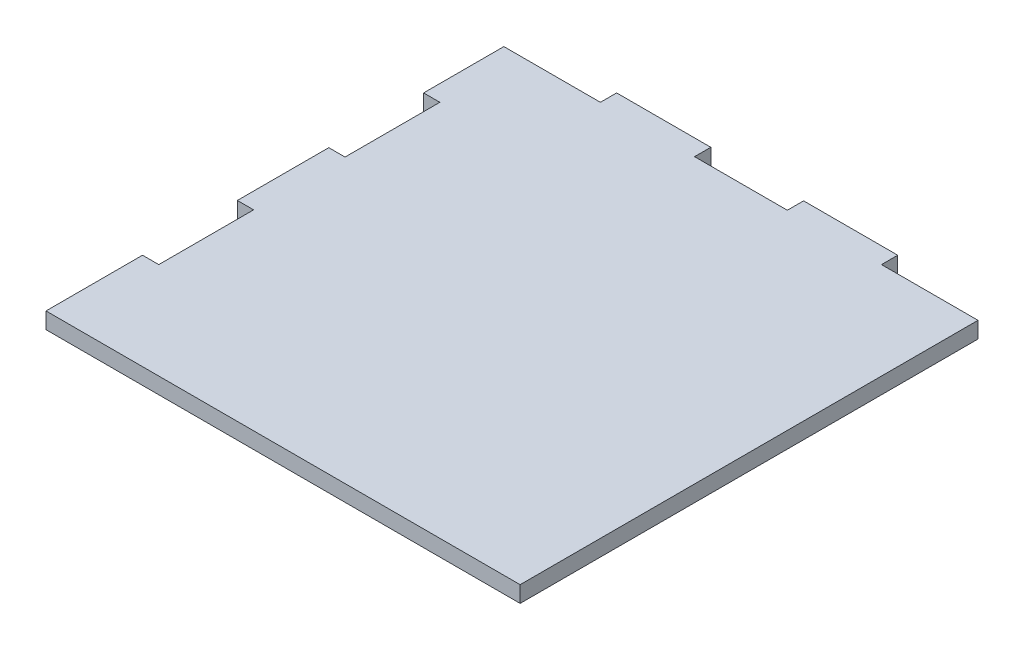
ISO-10303-21;
HEADER;
FILE_DESCRIPTION(('STEP AP214'),'2;1');
FILE_NAME('part.step','',(''),(''),'','','');
FILE_SCHEMA(('AUTOMOTIVE_DESIGN { 1 0 10303 214 1 1 1 1 }'));
ENDSEC;
DATA;
#1=APPLICATION_CONTEXT('core data for automotive mechanical design processes');
#2=APPLICATION_PROTOCOL_DEFINITION('international standard','automotive_design',2000,#1);
#3=PRODUCT_CONTEXT('',#1,'mechanical');
#4=PRODUCT('Part','Part','',(#3));
#5=PRODUCT_RELATED_PRODUCT_CATEGORY('part','',(#4));
#6=PRODUCT_DEFINITION_FORMATION('','',#4);
#7=PRODUCT_DEFINITION_CONTEXT('part definition',#1,'design');
#8=PRODUCT_DEFINITION('design','',#6,#7);
#9=PRODUCT_DEFINITION_SHAPE('','',#8);
#10=(LENGTH_UNIT() NAMED_UNIT(*) SI_UNIT(.MILLI.,.METRE.));
#11=(NAMED_UNIT(*) PLANE_ANGLE_UNIT() SI_UNIT($,.RADIAN.));
#12=(NAMED_UNIT(*) SI_UNIT($,.STERADIAN.) SOLID_ANGLE_UNIT());
#13=UNCERTAINTY_MEASURE_WITH_UNIT(LENGTH_MEASURE(1.E-05),#10,'distance_accuracy_value','');
#14=(GEOMETRIC_REPRESENTATION_CONTEXT(3) GLOBAL_UNCERTAINTY_ASSIGNED_CONTEXT((#13)) GLOBAL_UNIT_ASSIGNED_CONTEXT((#10,
#11,#12)) REPRESENTATION_CONTEXT('',''));
#15=CARTESIAN_POINT('',(0.,0.,0.));
#16=DIRECTION('',(0.,0.,1.));
#17=DIRECTION('',(1.,0.,0.));
#18=AXIS2_PLACEMENT_3D('',#15,#16,#17);
#19=CARTESIAN_POINT('',(0.,12.,0.));
#20=DIRECTION('',(1.,0.,0.));
#21=DIRECTION('',(0.,0.,-1.));
#22=AXIS2_PLACEMENT_3D('',#19,#20,#21);
#23=PLANE('',#22);
#24=DIRECTION('',(0.,0.,1.));
#25=VECTOR('',#24,1.);
#26=CARTESIAN_POINT('',(0.,0.,0.));
#27=LINE('',#26,#25);
#28=CARTESIAN_POINT('',(0.,0.,-71.25));
#29=VERTEX_POINT('',#28);
#30=CARTESIAN_POINT('',(0.,0.,0.));
#31=VERTEX_POINT('',#30);
#32=EDGE_CURVE('E205',#29,#31,#27,.T.);
#33=ORIENTED_EDGE('',*,*,#32,.T.);
#34=DIRECTION('',(0.,-1.,0.));
#35=VECTOR('',#34,1.);
#36=CARTESIAN_POINT('',(0.,12.,0.));
#37=LINE('',#36,#35);
#38=CARTESIAN_POINT('',(0.,12.,0.));
#39=VERTEX_POINT('',#38);
#40=EDGE_CURVE('E11',#39,#31,#37,.T.);
#41=ORIENTED_EDGE('',*,*,#40,.F.);
#42=DIRECTION('',(0.,0.,1.));
#43=VECTOR('',#42,1.);
#44=CARTESIAN_POINT('',(0.,12.,0.));
#45=LINE('',#44,#43);
#46=CARTESIAN_POINT('',(0.,12.,-71.25));
#47=VERTEX_POINT('',#46);
#48=EDGE_CURVE('E243',#47,#39,#45,.T.);
#49=ORIENTED_EDGE('',*,*,#48,.F.);
#50=DIRECTION('',(0.,-1.,0.));
#51=VECTOR('',#50,1.);
#52=CARTESIAN_POINT('',(0.,12.,-71.25));
#53=LINE('',#52,#51);
#54=EDGE_CURVE('E201',#47,#29,#53,.T.);
#55=ORIENTED_EDGE('',*,*,#54,.T.);
#56=EDGE_LOOP('',(#33,#41,#49,#55));
#57=FACE_BOUND('',#56,.T.);
#58=ADVANCED_FACE('F37',(#57),#23,.F.);
#59=CARTESIAN_POINT('',(0.,12.,0.));
#60=DIRECTION('',(0.,0.,-1.));
#61=DIRECTION('',(-1.,0.,0.));
#62=AXIS2_PLACEMENT_3D('',#59,#60,#61);
#63=PLANE('',#62);
#64=DIRECTION('',(1.,0.,0.));
#65=VECTOR('',#64,1.);
#66=CARTESIAN_POINT('',(0.,0.,0.));
#67=LINE('',#66,#65);
#68=CARTESIAN_POINT('',(350.,0.,0.));
#69=VERTEX_POINT('',#68);
#70=EDGE_CURVE('E208',#31,#69,#67,.T.);
#71=ORIENTED_EDGE('',*,*,#70,.T.);
#72=DIRECTION('',(0.,-1.,0.));
#73=VECTOR('',#72,1.);
#74=CARTESIAN_POINT('',(350.,12.,0.));
#75=LINE('',#74,#73);
#76=CARTESIAN_POINT('',(350.,12.,0.));
#77=VERTEX_POINT('',#76);
#78=EDGE_CURVE('E45',#77,#69,#75,.T.);
#79=ORIENTED_EDGE('',*,*,#78,.F.);
#80=DIRECTION('',(1.,0.,0.));
#81=VECTOR('',#80,1.);
#82=CARTESIAN_POINT('',(0.,12.,0.));
#83=LINE('',#82,#81);
#84=EDGE_CURVE('E132',#39,#77,#83,.T.);
#85=ORIENTED_EDGE('',*,*,#84,.F.);
#86=ORIENTED_EDGE('',*,*,#40,.T.);
#87=EDGE_LOOP('',(#71,#79,#85,#86));
#88=FACE_BOUND('',#87,.T.);
#89=ADVANCED_FACE('F361',(#88),#63,.F.);
#90=CARTESIAN_POINT('',(350.,12.,-338.));
#91=DIRECTION('',(-1.,0.,0.));
#92=DIRECTION('',(0.,0.,1.));
#93=AXIS2_PLACEMENT_3D('',#90,#91,#92);
#94=PLANE('',#93);
#95=DIRECTION('',(0.,0.,-1.));
#96=VECTOR('',#95,1.);
#97=CARTESIAN_POINT('',(350.,0.,-338.));
#98=LINE('',#97,#96);
#99=CARTESIAN_POINT('',(350.,0.,-338.));
#100=VERTEX_POINT('',#99);
#101=EDGE_CURVE('E210',#69,#100,#98,.T.);
#102=ORIENTED_EDGE('',*,*,#101,.T.);
#103=DIRECTION('',(0.,-1.,0.));
#104=VECTOR('',#103,1.);
#105=CARTESIAN_POINT('',(350.,12.,-338.));
#106=LINE('',#105,#104);
#107=CARTESIAN_POINT('',(350.,12.,-338.));
#108=VERTEX_POINT('',#107);
#109=EDGE_CURVE('E286',#108,#100,#106,.T.);
#110=ORIENTED_EDGE('',*,*,#109,.F.);
#111=DIRECTION('',(0.,0.,-1.));
#112=VECTOR('',#111,1.);
#113=CARTESIAN_POINT('',(350.,12.,-338.));
#114=LINE('',#113,#112);
#115=EDGE_CURVE('E294',#77,#108,#114,.T.);
#116=ORIENTED_EDGE('',*,*,#115,.F.);
#117=ORIENTED_EDGE('',*,*,#78,.T.);
#118=EDGE_LOOP('',(#102,#110,#116,#117));
#119=FACE_BOUND('',#118,.T.);
#120=ADVANCED_FACE('F292',(#119),#94,.F.);
#121=CARTESIAN_POINT('',(350.,12.,-338.));
#122=DIRECTION('',(0.,0.,1.));
#123=DIRECTION('',(1.,0.,0.));
#124=AXIS2_PLACEMENT_3D('',#121,#122,#123);
#125=PLANE('',#124);
#126=DIRECTION('',(-1.,0.,0.));
#127=VECTOR('',#126,1.);
#128=CARTESIAN_POINT('',(350.,0.,-338.));
#129=LINE('',#128,#127);
#130=CARTESIAN_POINT('',(278.75,0.,-338.));
#131=VERTEX_POINT('',#130);
#132=EDGE_CURVE('E212',#100,#131,#129,.T.);
#133=ORIENTED_EDGE('',*,*,#132,.T.);
#134=DIRECTION('',(0.,-1.,0.));
#135=VECTOR('',#134,1.);
#136=CARTESIAN_POINT('',(278.75,12.,-338.));
#137=LINE('',#136,#135);
#138=CARTESIAN_POINT('',(278.75,12.,-338.));
#139=VERTEX_POINT('',#138);
#140=EDGE_CURVE('E283',#139,#131,#137,.T.);
#141=ORIENTED_EDGE('',*,*,#140,.F.);
#142=DIRECTION('',(-1.,0.,0.));
#143=VECTOR('',#142,1.);
#144=CARTESIAN_POINT('',(350.,12.,-338.));
#145=LINE('',#144,#143);
#146=EDGE_CURVE('E312',#108,#139,#145,.T.);
#147=ORIENTED_EDGE('',*,*,#146,.F.);
#148=ORIENTED_EDGE('',*,*,#109,.T.);
#149=EDGE_LOOP('',(#133,#141,#147,#148));
#150=FACE_BOUND('',#149,.T.);
#151=ADVANCED_FACE('F303',(#150),#125,.F.);
#152=CARTESIAN_POINT('',(278.75,12.,-350.));
#153=DIRECTION('',(-1.,0.,0.));
#154=DIRECTION('',(0.,0.,1.));
#155=AXIS2_PLACEMENT_3D('',#152,#153,#154);
#156=PLANE('',#155);
#157=DIRECTION('',(0.,0.,-1.));
#158=VECTOR('',#157,1.);
#159=CARTESIAN_POINT('',(278.75,0.,-350.));
#160=LINE('',#159,#158);
#161=CARTESIAN_POINT('',(278.75,0.,-350.));
#162=VERTEX_POINT('',#161);
#163=EDGE_CURVE('E214',#131,#162,#160,.T.);
#164=ORIENTED_EDGE('',*,*,#163,.T.);
#165=DIRECTION('',(0.,-1.,0.));
#166=VECTOR('',#165,1.);
#167=CARTESIAN_POINT('',(278.75,12.,-350.));
#168=LINE('',#167,#166);
#169=CARTESIAN_POINT('',(278.75,12.,-350.));
#170=VERTEX_POINT('',#169);
#171=EDGE_CURVE('E280',#170,#162,#168,.T.);
#172=ORIENTED_EDGE('',*,*,#171,.F.);
#173=DIRECTION('',(0.,0.,-1.));
#174=VECTOR('',#173,1.);
#175=CARTESIAN_POINT('',(278.75,12.,-350.));
#176=LINE('',#175,#174);
#177=EDGE_CURVE('E309',#139,#170,#176,.T.);
#178=ORIENTED_EDGE('',*,*,#177,.F.);
#179=ORIENTED_EDGE('',*,*,#140,.T.);
#180=EDGE_LOOP('',(#164,#172,#178,#179));
#181=FACE_BOUND('',#180,.T.);
#182=ADVANCED_FACE('F307',(#181),#156,.F.);
#183=CARTESIAN_POINT('',(209.25,12.,-350.));
#184=DIRECTION('',(0.,0.,1.));
#185=DIRECTION('',(1.,0.,0.));
#186=AXIS2_PLACEMENT_3D('',#183,#184,#185);
#187=PLANE('',#186);
#188=DIRECTION('',(-1.,0.,0.));
#189=VECTOR('',#188,1.);
#190=CARTESIAN_POINT('',(209.25,0.,-350.));
#191=LINE('',#190,#189);
#192=CARTESIAN_POINT('',(209.25,0.,-350.));
#193=VERTEX_POINT('',#192);
#194=EDGE_CURVE('E216',#162,#193,#191,.T.);
#195=ORIENTED_EDGE('',*,*,#194,.T.);
#196=DIRECTION('',(0.,-1.,0.));
#197=VECTOR('',#196,1.);
#198=CARTESIAN_POINT('',(209.25,12.,-350.));
#199=LINE('',#198,#197);
#200=CARTESIAN_POINT('',(209.25,12.,-350.));
#201=VERTEX_POINT('',#200);
#202=EDGE_CURVE('E277',#201,#193,#199,.T.);
#203=ORIENTED_EDGE('',*,*,#202,.F.);
#204=DIRECTION('',(-1.,0.,0.));
#205=VECTOR('',#204,1.);
#206=CARTESIAN_POINT('',(209.25,12.,-350.));
#207=LINE('',#206,#205);
#208=EDGE_CURVE('E311',#170,#201,#207,.T.);
#209=ORIENTED_EDGE('',*,*,#208,.F.);
#210=ORIENTED_EDGE('',*,*,#171,.T.);
#211=EDGE_LOOP('',(#195,#203,#209,#210));
#212=FACE_BOUND('',#211,.T.);
#213=ADVANCED_FACE('F374',(#212),#187,.F.);
#214=CARTESIAN_POINT('',(209.25,12.,-350.));
#215=DIRECTION('',(1.,0.,0.));
#216=DIRECTION('',(0.,0.,-1.));
#217=AXIS2_PLACEMENT_3D('',#214,#215,#216);
#218=PLANE('',#217);
#219=DIRECTION('',(0.,0.,1.));
#220=VECTOR('',#219,1.);
#221=CARTESIAN_POINT('',(209.25,0.,-350.));
#222=LINE('',#221,#220);
#223=CARTESIAN_POINT('',(209.25,0.,-338.));
#224=VERTEX_POINT('',#223);
#225=EDGE_CURVE('E218',#193,#224,#222,.T.);
#226=ORIENTED_EDGE('',*,*,#225,.T.);
#227=DIRECTION('',(0.,-1.,0.));
#228=VECTOR('',#227,1.);
#229=CARTESIAN_POINT('',(209.25,12.,-338.));
#230=LINE('',#229,#228);
#231=CARTESIAN_POINT('',(209.25,12.,-338.));
#232=VERTEX_POINT('',#231);
#233=EDGE_CURVE('E274',#232,#224,#230,.T.);
#234=ORIENTED_EDGE('',*,*,#233,.F.);
#235=DIRECTION('',(0.,0.,1.));
#236=VECTOR('',#235,1.);
#237=CARTESIAN_POINT('',(209.25,12.,-350.));
#238=LINE('',#237,#236);
#239=EDGE_CURVE('E314',#201,#232,#238,.T.);
#240=ORIENTED_EDGE('',*,*,#239,.F.);
#241=ORIENTED_EDGE('',*,*,#202,.T.);
#242=EDGE_LOOP('',(#226,#234,#240,#241));
#243=FACE_BOUND('',#242,.T.);
#244=ADVANCED_FACE('F377',(#243),#218,.F.);
#245=CARTESIAN_POINT('',(140.75,12.,-338.));
#246=DIRECTION('',(0.,0.,1.));
#247=DIRECTION('',(1.,0.,0.));
#248=AXIS2_PLACEMENT_3D('',#245,#246,#247);
#249=PLANE('',#248);
#250=DIRECTION('',(-1.,0.,0.));
#251=VECTOR('',#250,1.);
#252=CARTESIAN_POINT('',(140.75,0.,-338.));
#253=LINE('',#252,#251);
#254=CARTESIAN_POINT('',(140.75,0.,-338.));
#255=VERTEX_POINT('',#254);
#256=EDGE_CURVE('E220',#224,#255,#253,.T.);
#257=ORIENTED_EDGE('',*,*,#256,.T.);
#258=DIRECTION('',(0.,-1.,0.));
#259=VECTOR('',#258,1.);
#260=CARTESIAN_POINT('',(140.75,12.,-338.));
#261=LINE('',#260,#259);
#262=CARTESIAN_POINT('',(140.75,12.,-338.));
#263=VERTEX_POINT('',#262);
#264=EDGE_CURVE('E271',#263,#255,#261,.T.);
#265=ORIENTED_EDGE('',*,*,#264,.F.);
#266=DIRECTION('',(-1.,0.,0.));
#267=VECTOR('',#266,1.);
#268=CARTESIAN_POINT('',(140.75,12.,-338.));
#269=LINE('',#268,#267);
#270=EDGE_CURVE('E320',#232,#263,#269,.T.);
#271=ORIENTED_EDGE('',*,*,#270,.F.);
#272=ORIENTED_EDGE('',*,*,#233,.T.);
#273=EDGE_LOOP('',(#257,#265,#271,#272));
#274=FACE_BOUND('',#273,.T.);
#275=ADVANCED_FACE('F381',(#274),#249,.F.);
#276=CARTESIAN_POINT('',(140.75,12.,-350.));
#277=DIRECTION('',(-1.,0.,0.));
#278=DIRECTION('',(0.,0.,1.));
#279=AXIS2_PLACEMENT_3D('',#276,#277,#278);
#280=PLANE('',#279);
#281=DIRECTION('',(0.,0.,-1.));
#282=VECTOR('',#281,1.);
#283=CARTESIAN_POINT('',(140.75,0.,-350.));
#284=LINE('',#283,#282);
#285=CARTESIAN_POINT('',(140.75,0.,-350.));
#286=VERTEX_POINT('',#285);
#287=EDGE_CURVE('E222',#255,#286,#284,.T.);
#288=ORIENTED_EDGE('',*,*,#287,.T.);
#289=DIRECTION('',(0.,-1.,0.));
#290=VECTOR('',#289,1.);
#291=CARTESIAN_POINT('',(140.75,12.,-350.));
#292=LINE('',#291,#290);
#293=CARTESIAN_POINT('',(140.75,12.,-350.));
#294=VERTEX_POINT('',#293);
#295=EDGE_CURVE('E268',#294,#286,#292,.T.);
#296=ORIENTED_EDGE('',*,*,#295,.F.);
#297=DIRECTION('',(0.,0.,-1.));
#298=VECTOR('',#297,1.);
#299=CARTESIAN_POINT('',(140.75,12.,-350.));
#300=LINE('',#299,#298);
#301=EDGE_CURVE('E322',#263,#294,#300,.T.);
#302=ORIENTED_EDGE('',*,*,#301,.F.);
#303=ORIENTED_EDGE('',*,*,#264,.T.);
#304=EDGE_LOOP('',(#288,#296,#302,#303));
#305=FACE_BOUND('',#304,.T.);
#306=ADVANCED_FACE('F385',(#305),#280,.F.);
#307=CARTESIAN_POINT('',(71.25,12.,-350.));
#308=DIRECTION('',(0.,0.,1.));
#309=DIRECTION('',(1.,0.,0.));
#310=AXIS2_PLACEMENT_3D('',#307,#308,#309);
#311=PLANE('',#310);
#312=DIRECTION('',(-1.,0.,0.));
#313=VECTOR('',#312,1.);
#314=CARTESIAN_POINT('',(71.25,0.,-350.));
#315=LINE('',#314,#313);
#316=CARTESIAN_POINT('',(71.25,0.,-350.));
#317=VERTEX_POINT('',#316);
#318=EDGE_CURVE('E224',#286,#317,#315,.T.);
#319=ORIENTED_EDGE('',*,*,#318,.T.);
#320=DIRECTION('',(0.,-1.,0.));
#321=VECTOR('',#320,1.);
#322=CARTESIAN_POINT('',(71.25,12.,-350.));
#323=LINE('',#322,#321);
#324=CARTESIAN_POINT('',(71.25,12.,-350.));
#325=VERTEX_POINT('',#324);
#326=EDGE_CURVE('E265',#325,#317,#323,.T.);
#327=ORIENTED_EDGE('',*,*,#326,.F.);
#328=DIRECTION('',(-1.,0.,0.));
#329=VECTOR('',#328,1.);
#330=CARTESIAN_POINT('',(71.25,12.,-350.));
#331=LINE('',#330,#329);
#332=EDGE_CURVE('E324',#294,#325,#331,.T.);
#333=ORIENTED_EDGE('',*,*,#332,.F.);
#334=ORIENTED_EDGE('',*,*,#295,.T.);
#335=EDGE_LOOP('',(#319,#327,#333,#334));
#336=FACE_BOUND('',#335,.T.);
#337=ADVANCED_FACE('F389',(#336),#311,.F.);
#338=CARTESIAN_POINT('',(71.25,12.,-350.));
#339=DIRECTION('',(1.,0.,0.));
#340=DIRECTION('',(0.,0.,-1.));
#341=AXIS2_PLACEMENT_3D('',#338,#339,#340);
#342=PLANE('',#341);
#343=DIRECTION('',(0.,0.,1.));
#344=VECTOR('',#343,1.);
#345=CARTESIAN_POINT('',(71.25,0.,-350.));
#346=LINE('',#345,#344);
#347=CARTESIAN_POINT('',(71.25,0.,-338.));
#348=VERTEX_POINT('',#347);
#349=EDGE_CURVE('E226',#317,#348,#346,.T.);
#350=ORIENTED_EDGE('',*,*,#349,.T.);
#351=DIRECTION('',(0.,-1.,0.));
#352=VECTOR('',#351,1.);
#353=CARTESIAN_POINT('',(71.25,12.,-338.));
#354=LINE('',#353,#352);
#355=CARTESIAN_POINT('',(71.25,12.,-338.));
#356=VERTEX_POINT('',#355);
#357=EDGE_CURVE('E262',#356,#348,#354,.T.);
#358=ORIENTED_EDGE('',*,*,#357,.F.);
#359=DIRECTION('',(0.,0.,1.));
#360=VECTOR('',#359,1.);
#361=CARTESIAN_POINT('',(71.25,12.,-350.));
#362=LINE('',#361,#360);
#363=EDGE_CURVE('E326',#325,#356,#362,.T.);
#364=ORIENTED_EDGE('',*,*,#363,.F.);
#365=ORIENTED_EDGE('',*,*,#326,.T.);
#366=EDGE_LOOP('',(#350,#358,#364,#365));
#367=FACE_BOUND('',#366,.T.);
#368=ADVANCED_FACE('F393',(#367),#342,.F.);
#369=CARTESIAN_POINT('',(0.,12.,-338.));
#370=DIRECTION('',(0.,0.,1.));
#371=DIRECTION('',(1.,0.,0.));
#372=AXIS2_PLACEMENT_3D('',#369,#370,#371);
#373=PLANE('',#372);
#374=DIRECTION('',(-1.,0.,0.));
#375=VECTOR('',#374,1.);
#376=CARTESIAN_POINT('',(0.,0.,-338.));
#377=LINE('',#376,#375);
#378=CARTESIAN_POINT('',(0.,0.,-338.));
#379=VERTEX_POINT('',#378);
#380=EDGE_CURVE('E228',#348,#379,#377,.T.);
#381=ORIENTED_EDGE('',*,*,#380,.T.);
#382=DIRECTION('',(0.,-1.,0.));
#383=VECTOR('',#382,1.);
#384=CARTESIAN_POINT('',(0.,12.,-338.));
#385=LINE('',#384,#383);
#386=CARTESIAN_POINT('',(0.,12.,-338.));
#387=VERTEX_POINT('',#386);
#388=EDGE_CURVE('E259',#387,#379,#385,.T.);
#389=ORIENTED_EDGE('',*,*,#388,.F.);
#390=DIRECTION('',(-1.,0.,0.));
#391=VECTOR('',#390,1.);
#392=CARTESIAN_POINT('',(0.,12.,-338.));
#393=LINE('',#392,#391);
#394=EDGE_CURVE('E328',#356,#387,#393,.T.);
#395=ORIENTED_EDGE('',*,*,#394,.F.);
#396=ORIENTED_EDGE('',*,*,#357,.T.);
#397=EDGE_LOOP('',(#381,#389,#395,#396));
#398=FACE_BOUND('',#397,.T.);
#399=ADVANCED_FACE('F397',(#398),#373,.F.);
#400=CARTESIAN_POINT('',(0.,12.,-278.75));
#401=DIRECTION('',(1.,0.,0.));
#402=DIRECTION('',(0.,0.,-1.));
#403=AXIS2_PLACEMENT_3D('',#400,#401,#402);
#404=PLANE('',#403);
#405=DIRECTION('',(0.,0.,1.));
#406=VECTOR('',#405,1.);
#407=CARTESIAN_POINT('',(0.,0.,-278.75));
#408=LINE('',#407,#406);
#409=CARTESIAN_POINT('',(0.,0.,-278.75));
#410=VERTEX_POINT('',#409);
#411=EDGE_CURVE('E230',#379,#410,#408,.T.);
#412=ORIENTED_EDGE('',*,*,#411,.T.);
#413=DIRECTION('',(0.,-1.,0.));
#414=VECTOR('',#413,1.);
#415=CARTESIAN_POINT('',(0.,12.,-278.75));
#416=LINE('',#415,#414);
#417=CARTESIAN_POINT('',(0.,12.,-278.75));
#418=VERTEX_POINT('',#417);
#419=EDGE_CURVE('E256',#418,#410,#416,.T.);
#420=ORIENTED_EDGE('',*,*,#419,.F.);
#421=DIRECTION('',(0.,0.,1.));
#422=VECTOR('',#421,1.);
#423=CARTESIAN_POINT('',(0.,12.,-278.75));
#424=LINE('',#423,#422);
#425=EDGE_CURVE('E330',#387,#418,#424,.T.);
#426=ORIENTED_EDGE('',*,*,#425,.F.);
#427=ORIENTED_EDGE('',*,*,#388,.T.);
#428=EDGE_LOOP('',(#412,#420,#426,#427));
#429=FACE_BOUND('',#428,.T.);
#430=ADVANCED_FACE('F401',(#429),#404,.F.);
#431=CARTESIAN_POINT('',(0.,12.,-278.75));
#432=DIRECTION('',(0.,0.,-1.));
#433=DIRECTION('',(-1.,0.,0.));
#434=AXIS2_PLACEMENT_3D('',#431,#432,#433);
#435=PLANE('',#434);
#436=DIRECTION('',(1.,0.,0.));
#437=VECTOR('',#436,1.);
#438=CARTESIAN_POINT('',(0.,0.,-278.75));
#439=LINE('',#438,#437);
#440=CARTESIAN_POINT('',(12.,0.,-278.75));
#441=VERTEX_POINT('',#440);
#442=EDGE_CURVE('E232',#410,#441,#439,.T.);
#443=ORIENTED_EDGE('',*,*,#442,.T.);
#444=DIRECTION('',(0.,-1.,0.));
#445=VECTOR('',#444,1.);
#446=CARTESIAN_POINT('',(12.,12.,-278.75));
#447=LINE('',#446,#445);
#448=CARTESIAN_POINT('',(12.,12.,-278.75));
#449=VERTEX_POINT('',#448);
#450=EDGE_CURVE('E253',#449,#441,#447,.T.);
#451=ORIENTED_EDGE('',*,*,#450,.F.);
#452=DIRECTION('',(1.,0.,0.));
#453=VECTOR('',#452,1.);
#454=CARTESIAN_POINT('',(0.,12.,-278.75));
#455=LINE('',#454,#453);
#456=EDGE_CURVE('E332',#418,#449,#455,.T.);
#457=ORIENTED_EDGE('',*,*,#456,.F.);
#458=ORIENTED_EDGE('',*,*,#419,.T.);
#459=EDGE_LOOP('',(#443,#451,#457,#458));
#460=FACE_BOUND('',#459,.T.);
#461=ADVANCED_FACE('F405',(#460),#435,.F.);
#462=CARTESIAN_POINT('',(12.,12.,-278.75));
#463=DIRECTION('',(1.,0.,0.));
#464=DIRECTION('',(0.,0.,-1.));
#465=AXIS2_PLACEMENT_3D('',#462,#463,#464);
#466=PLANE('',#465);
#467=DIRECTION('',(0.,0.,1.));
#468=VECTOR('',#467,1.);
#469=CARTESIAN_POINT('',(12.,0.,-278.75));
#470=LINE('',#469,#468);
#471=CARTESIAN_POINT('',(12.,0.,-208.75));
#472=VERTEX_POINT('',#471);
#473=EDGE_CURVE('E234',#441,#472,#470,.T.);
#474=ORIENTED_EDGE('',*,*,#473,.T.);
#475=DIRECTION('',(0.,-1.,0.));
#476=VECTOR('',#475,1.);
#477=CARTESIAN_POINT('',(12.,12.,-208.75));
#478=LINE('',#477,#476);
#479=CARTESIAN_POINT('',(12.,12.,-208.75));
#480=VERTEX_POINT('',#479);
#481=EDGE_CURVE('E250',#480,#472,#478,.T.);
#482=ORIENTED_EDGE('',*,*,#481,.F.);
#483=DIRECTION('',(0.,0.,1.));
#484=VECTOR('',#483,1.);
#485=CARTESIAN_POINT('',(12.,12.,-278.75));
#486=LINE('',#485,#484);
#487=EDGE_CURVE('E334',#449,#480,#486,.T.);
#488=ORIENTED_EDGE('',*,*,#487,.F.);
#489=ORIENTED_EDGE('',*,*,#450,.T.);
#490=EDGE_LOOP('',(#474,#482,#488,#489));
#491=FACE_BOUND('',#490,.T.);
#492=ADVANCED_FACE('F409',(#491),#466,.F.);
#493=CARTESIAN_POINT('',(0.,12.,-208.75));
#494=DIRECTION('',(0.,0.,1.));
#495=DIRECTION('',(1.,0.,0.));
#496=AXIS2_PLACEMENT_3D('',#493,#494,#495);
#497=PLANE('',#496);
#498=DIRECTION('',(-1.,0.,0.));
#499=VECTOR('',#498,1.);
#500=CARTESIAN_POINT('',(0.,0.,-208.75));
#501=LINE('',#500,#499);
#502=CARTESIAN_POINT('',(0.,0.,-208.75));
#503=VERTEX_POINT('',#502);
#504=EDGE_CURVE('E236',#472,#503,#501,.T.);
#505=ORIENTED_EDGE('',*,*,#504,.T.);
#506=DIRECTION('',(0.,-1.,0.));
#507=VECTOR('',#506,1.);
#508=CARTESIAN_POINT('',(0.,12.,-208.75));
#509=LINE('',#508,#507);
#510=CARTESIAN_POINT('',(0.,12.,-208.75));
#511=VERTEX_POINT('',#510);
#512=EDGE_CURVE('E247',#511,#503,#509,.T.);
#513=ORIENTED_EDGE('',*,*,#512,.F.);
#514=DIRECTION('',(-1.,0.,0.));
#515=VECTOR('',#514,1.);
#516=CARTESIAN_POINT('',(0.,12.,-208.75));
#517=LINE('',#516,#515);
#518=EDGE_CURVE('E336',#480,#511,#517,.T.);
#519=ORIENTED_EDGE('',*,*,#518,.F.);
#520=ORIENTED_EDGE('',*,*,#481,.T.);
#521=EDGE_LOOP('',(#505,#513,#519,#520));
#522=FACE_BOUND('',#521,.T.);
#523=ADVANCED_FACE('F342',(#522),#497,.F.);
#524=CARTESIAN_POINT('',(0.,12.,-141.25));
#525=DIRECTION('',(1.,0.,0.));
#526=DIRECTION('',(0.,0.,-1.));
#527=AXIS2_PLACEMENT_3D('',#524,#525,#526);
#528=PLANE('',#527);
#529=DIRECTION('',(0.,0.,1.));
#530=VECTOR('',#529,1.);
#531=CARTESIAN_POINT('',(0.,0.,-141.25));
#532=LINE('',#531,#530);
#533=CARTESIAN_POINT('',(0.,0.,-141.25));
#534=VERTEX_POINT('',#533);
#535=EDGE_CURVE('E238',#503,#534,#532,.T.);
#536=ORIENTED_EDGE('',*,*,#535,.T.);
#537=DIRECTION('',(0.,-1.,0.));
#538=VECTOR('',#537,1.);
#539=CARTESIAN_POINT('',(0.,12.,-141.25));
#540=LINE('',#539,#538);
#541=CARTESIAN_POINT('',(0.,12.,-141.25));
#542=VERTEX_POINT('',#541);
#543=EDGE_CURVE('E196',#542,#534,#540,.T.);
#544=ORIENTED_EDGE('',*,*,#543,.F.);
#545=DIRECTION('',(0.,0.,1.));
#546=VECTOR('',#545,1.);
#547=CARTESIAN_POINT('',(0.,12.,-141.25));
#548=LINE('',#547,#546);
#549=EDGE_CURVE('E187',#511,#542,#548,.T.);
#550=ORIENTED_EDGE('',*,*,#549,.F.);
#551=ORIENTED_EDGE('',*,*,#512,.T.);
#552=EDGE_LOOP('',(#536,#544,#550,#551));
#553=FACE_BOUND('',#552,.T.);
#554=ADVANCED_FACE('F346',(#553),#528,.F.);
#555=CARTESIAN_POINT('',(0.,12.,-141.25));
#556=DIRECTION('',(0.,0.,-1.));
#557=DIRECTION('',(-1.,0.,0.));
#558=AXIS2_PLACEMENT_3D('',#555,#556,#557);
#559=PLANE('',#558);
#560=DIRECTION('',(1.,0.,0.));
#561=VECTOR('',#560,1.);
#562=CARTESIAN_POINT('',(0.,0.,-141.25));
#563=LINE('',#562,#561);
#564=CARTESIAN_POINT('',(12.,0.,-141.25));
#565=VERTEX_POINT('',#564);
#566=EDGE_CURVE('E195',#534,#565,#563,.T.);
#567=ORIENTED_EDGE('',*,*,#566,.T.);
#568=DIRECTION('',(0.,-1.,0.));
#569=VECTOR('',#568,1.);
#570=CARTESIAN_POINT('',(12.,12.,-141.25));
#571=LINE('',#570,#569);
#572=CARTESIAN_POINT('',(12.,12.,-141.25));
#573=VERTEX_POINT('',#572);
#574=EDGE_CURVE('E192',#573,#565,#571,.T.);
#575=ORIENTED_EDGE('',*,*,#574,.F.);
#576=DIRECTION('',(1.,0.,0.));
#577=VECTOR('',#576,1.);
#578=CARTESIAN_POINT('',(0.,12.,-141.25));
#579=LINE('',#578,#577);
#580=EDGE_CURVE('E181',#542,#573,#579,.T.);
#581=ORIENTED_EDGE('',*,*,#580,.F.);
#582=ORIENTED_EDGE('',*,*,#543,.T.);
#583=EDGE_LOOP('',(#567,#575,#581,#582));
#584=FACE_BOUND('',#583,.T.);
#585=ADVANCED_FACE('F193',(#584),#559,.F.);
#586=CARTESIAN_POINT('',(12.,12.,-141.25));
#587=DIRECTION('',(1.,0.,0.));
#588=DIRECTION('',(0.,0.,-1.));
#589=AXIS2_PLACEMENT_3D('',#586,#587,#588);
#590=PLANE('',#589);
#591=DIRECTION('',(0.,0.,1.));
#592=VECTOR('',#591,1.);
#593=CARTESIAN_POINT('',(12.,0.,-141.25));
#594=LINE('',#593,#592);
#595=CARTESIAN_POINT('',(12.,0.,-71.25));
#596=VERTEX_POINT('',#595);
#597=EDGE_CURVE('E118',#565,#596,#594,.T.);
#598=ORIENTED_EDGE('',*,*,#597,.T.);
#599=DIRECTION('',(0.,-1.,0.));
#600=VECTOR('',#599,1.);
#601=CARTESIAN_POINT('',(12.,12.,-71.25));
#602=LINE('',#601,#600);
#603=CARTESIAN_POINT('',(12.,12.,-71.25));
#604=VERTEX_POINT('',#603);
#605=EDGE_CURVE('E197',#604,#596,#602,.T.);
#606=ORIENTED_EDGE('',*,*,#605,.F.);
#607=DIRECTION('',(0.,0.,1.));
#608=VECTOR('',#607,1.);
#609=CARTESIAN_POINT('',(12.,12.,-141.25));
#610=LINE('',#609,#608);
#611=EDGE_CURVE('E185',#573,#604,#610,.T.);
#612=ORIENTED_EDGE('',*,*,#611,.F.);
#613=ORIENTED_EDGE('',*,*,#574,.T.);
#614=EDGE_LOOP('',(#598,#606,#612,#613));
#615=FACE_BOUND('',#614,.T.);
#616=ADVANCED_FACE('F199',(#615),#590,.F.);
#617=CARTESIAN_POINT('',(0.,12.,-71.25));
#618=DIRECTION('',(0.,0.,1.));
#619=DIRECTION('',(1.,0.,0.));
#620=AXIS2_PLACEMENT_3D('',#617,#618,#619);
#621=PLANE('',#620);
#622=DIRECTION('',(-1.,0.,0.));
#623=VECTOR('',#622,1.);
#624=CARTESIAN_POINT('',(0.,0.,-71.25));
#625=LINE('',#624,#623);
#626=EDGE_CURVE('E124',#596,#29,#625,.T.);
#627=ORIENTED_EDGE('',*,*,#626,.T.);
#628=ORIENTED_EDGE('',*,*,#54,.F.);
#629=DIRECTION('',(-1.,0.,0.));
#630=VECTOR('',#629,1.);
#631=CARTESIAN_POINT('',(0.,12.,-71.25));
#632=LINE('',#631,#630);
#633=EDGE_CURVE('E53',#604,#47,#632,.T.);
#634=ORIENTED_EDGE('',*,*,#633,.F.);
#635=ORIENTED_EDGE('',*,*,#605,.T.);
#636=EDGE_LOOP('',(#627,#628,#634,#635));
#637=FACE_BOUND('',#636,.T.);
#638=ADVANCED_FACE('F350',(#637),#621,.F.);
#639=CARTESIAN_POINT('',(0.,12.,0.));
#640=DIRECTION('',(0.,-1.,0.));
#641=DIRECTION('',(0.,0.,-1.));
#642=AXIS2_PLACEMENT_3D('',#639,#640,#641);
#643=PLANE('',#642);
#644=ORIENTED_EDGE('',*,*,#48,.T.);
#645=ORIENTED_EDGE('',*,*,#84,.T.);
#646=ORIENTED_EDGE('',*,*,#115,.T.);
#647=ORIENTED_EDGE('',*,*,#146,.T.);
#648=ORIENTED_EDGE('',*,*,#177,.T.);
#649=ORIENTED_EDGE('',*,*,#208,.T.);
#650=ORIENTED_EDGE('',*,*,#239,.T.);
#651=ORIENTED_EDGE('',*,*,#270,.T.);
#652=ORIENTED_EDGE('',*,*,#301,.T.);
#653=ORIENTED_EDGE('',*,*,#332,.T.);
#654=ORIENTED_EDGE('',*,*,#363,.T.);
#655=ORIENTED_EDGE('',*,*,#394,.T.);
#656=ORIENTED_EDGE('',*,*,#425,.T.);
#657=ORIENTED_EDGE('',*,*,#456,.T.);
#658=ORIENTED_EDGE('',*,*,#487,.T.);
#659=ORIENTED_EDGE('',*,*,#518,.T.);
#660=ORIENTED_EDGE('',*,*,#549,.T.);
#661=ORIENTED_EDGE('',*,*,#580,.T.);
#662=ORIENTED_EDGE('',*,*,#611,.T.);
#663=ORIENTED_EDGE('',*,*,#633,.T.);
#664=EDGE_LOOP('',(#644,#645,#646,#647,#648,#649,#650,#651,#652,#653,#654,#655,#656,#657,#658,
#659,#660,#661,#662,#663));
#665=FACE_BOUND('',#664,.T.);
#666=ADVANCED_FACE('F183',(#665),#643,.F.);
#667=CARTESIAN_POINT('',(0.,0.,0.));
#668=DIRECTION('',(0.,-1.,0.));
#669=DIRECTION('',(0.,0.,-1.));
#670=AXIS2_PLACEMENT_3D('',#667,#668,#669);
#671=PLANE('',#670);
#672=ORIENTED_EDGE('',*,*,#32,.F.);
#673=ORIENTED_EDGE('',*,*,#626,.F.);
#674=ORIENTED_EDGE('',*,*,#597,.F.);
#675=ORIENTED_EDGE('',*,*,#566,.F.);
#676=ORIENTED_EDGE('',*,*,#535,.F.);
#677=ORIENTED_EDGE('',*,*,#504,.F.);
#678=ORIENTED_EDGE('',*,*,#473,.F.);
#679=ORIENTED_EDGE('',*,*,#442,.F.);
#680=ORIENTED_EDGE('',*,*,#411,.F.);
#681=ORIENTED_EDGE('',*,*,#380,.F.);
#682=ORIENTED_EDGE('',*,*,#349,.F.);
#683=ORIENTED_EDGE('',*,*,#318,.F.);
#684=ORIENTED_EDGE('',*,*,#287,.F.);
#685=ORIENTED_EDGE('',*,*,#256,.F.);
#686=ORIENTED_EDGE('',*,*,#225,.F.);
#687=ORIENTED_EDGE('',*,*,#194,.F.);
#688=ORIENTED_EDGE('',*,*,#163,.F.);
#689=ORIENTED_EDGE('',*,*,#132,.F.);
#690=ORIENTED_EDGE('',*,*,#101,.F.);
#691=ORIENTED_EDGE('',*,*,#70,.F.);
#692=EDGE_LOOP('',(#672,#673,#674,#675,#676,#677,#678,#679,#680,#681,#682,#683,#684,#685,#686,
#687,#688,#689,#690,#691));
#693=FACE_BOUND('',#692,.T.);
#694=ADVANCED_FACE('F298',(#693),#671,.T.);
#695=CLOSED_SHELL('',(#58,#89,#120,#151,#182,#213,#244,#275,#306,#337,#368,#399,#430,#461,#492,
#523,#554,#585,#616,#638,#666,#694));
#696=MANIFOLD_SOLID_BREP('B2',#695);
#697=ADVANCED_BREP_SHAPE_REPRESENTATION('',(#18,#696),#14);
#698=SHAPE_DEFINITION_REPRESENTATION(#9,#697);
ENDSEC;
END-ISO-10303-21;
